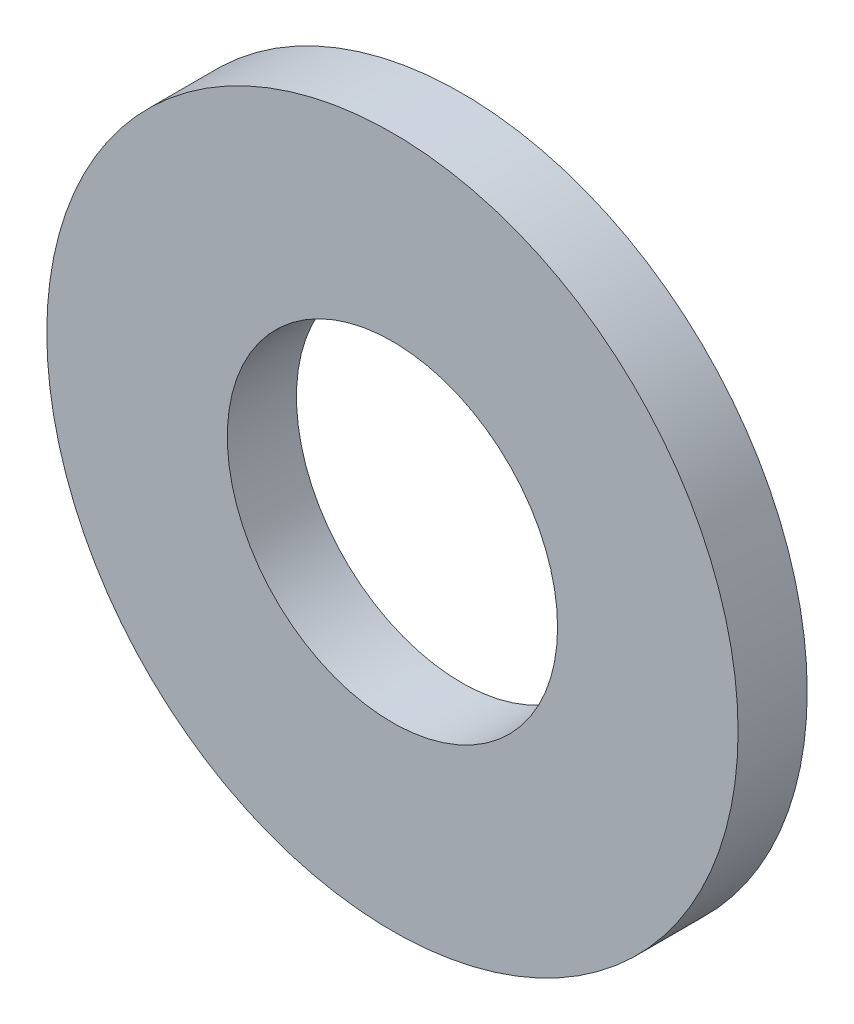
ISO-10303-21;
HEADER;
FILE_DESCRIPTION(('STEP AP214'),'2;1');
FILE_NAME('part.step','',(''),(''),'','','');
FILE_SCHEMA(('AUTOMOTIVE_DESIGN { 1 0 10303 214 1 1 1 1 }'));
ENDSEC;
DATA;
#1=APPLICATION_CONTEXT('core data for automotive mechanical design processes');
#2=APPLICATION_PROTOCOL_DEFINITION('international standard','automotive_design',2000,#1);
#3=PRODUCT_CONTEXT('',#1,'mechanical');
#4=PRODUCT('Part','Part','',(#3));
#5=PRODUCT_RELATED_PRODUCT_CATEGORY('part','',(#4));
#6=PRODUCT_DEFINITION_FORMATION('','',#4);
#7=PRODUCT_DEFINITION_CONTEXT('part definition',#1,'design');
#8=PRODUCT_DEFINITION('design','',#6,#7);
#9=PRODUCT_DEFINITION_SHAPE('','',#8);
#10=(LENGTH_UNIT() NAMED_UNIT(*) SI_UNIT(.MILLI.,.METRE.));
#11=(NAMED_UNIT(*) PLANE_ANGLE_UNIT() SI_UNIT($,.RADIAN.));
#12=(NAMED_UNIT(*) SI_UNIT($,.STERADIAN.) SOLID_ANGLE_UNIT());
#13=UNCERTAINTY_MEASURE_WITH_UNIT(LENGTH_MEASURE(1.E-05),#10,'distance_accuracy_value','');
#14=(GEOMETRIC_REPRESENTATION_CONTEXT(3) GLOBAL_UNCERTAINTY_ASSIGNED_CONTEXT((#13)) GLOBAL_UNIT_ASSIGNED_CONTEXT((#10,
#11,#12)) REPRESENTATION_CONTEXT('',''));
#15=CARTESIAN_POINT('',(0.,0.,0.));
#16=DIRECTION('',(0.,0.,1.));
#17=DIRECTION('',(1.,0.,0.));
#18=AXIS2_PLACEMENT_3D('',#15,#16,#17);
#19=CARTESIAN_POINT('',(0.,0.,0.));
#20=DIRECTION('',(0.,0.,1.));
#21=DIRECTION('',(1.,0.,0.));
#22=AXIS2_PLACEMENT_3D('',#19,#20,#21);
#23=PLANE('',#22);
#24=CARTESIAN_POINT('',(0.,0.,0.));
#25=DIRECTION('',(0.,0.,1.));
#26=DIRECTION('',(1.,0.,0.));
#27=AXIS2_PLACEMENT_3D('',#24,#25,#26);
#28=CIRCLE('',#27,2.15);
#29=CARTESIAN_POINT('',(2.15,0.,0.));
#30=VERTEX_POINT('',#29);
#31=EDGE_CURVE('E27',#30,#30,#28,.T.);
#32=ORIENTED_EDGE('',*,*,#31,.T.);
#33=EDGE_LOOP('',(#32));
#34=FACE_BOUND('',#33,.T.);
#35=CARTESIAN_POINT('',(0.,0.,0.));
#36=DIRECTION('',(0.,0.,1.));
#37=DIRECTION('',(1.,0.,0.));
#38=AXIS2_PLACEMENT_3D('',#35,#36,#37);
#39=CIRCLE('',#38,4.50000000000001);
#40=CARTESIAN_POINT('',(4.50000000000001,0.,0.));
#41=VERTEX_POINT('',#40);
#42=EDGE_CURVE('E18',#41,#41,#39,.T.);
#43=ORIENTED_EDGE('',*,*,#42,.F.);
#44=EDGE_LOOP('',(#43));
#45=FACE_BOUND('',#44,.T.);
#46=ADVANCED_FACE('F15',(#34,#45),#23,.F.);
#47=CARTESIAN_POINT('',(0.,0.,0.));
#48=DIRECTION('',(0.,0.,1.));
#49=DIRECTION('',(1.,0.,0.));
#50=AXIS2_PLACEMENT_3D('',#47,#48,#49);
#51=CYLINDRICAL_SURFACE('',#50,4.50000000000001);
#52=ORIENTED_EDGE('',*,*,#42,.T.);
#53=EDGE_LOOP('',(#52));
#54=FACE_BOUND('',#53,.T.);
#55=CARTESIAN_POINT('',(0.,0.,0.899999999999999));
#56=DIRECTION('',(0.,0.,1.));
#57=DIRECTION('',(1.,0.,0.));
#58=AXIS2_PLACEMENT_3D('',#55,#56,#57);
#59=CIRCLE('',#58,4.50000000000001);
#60=CARTESIAN_POINT('',(4.50000000000001,0.,0.899999999999999));
#61=VERTEX_POINT('',#60);
#62=EDGE_CURVE('E22',#61,#61,#59,.T.);
#63=ORIENTED_EDGE('',*,*,#62,.F.);
#64=EDGE_LOOP('',(#63));
#65=FACE_BOUND('',#64,.T.);
#66=ADVANCED_FACE('F35',(#54,#65),#51,.T.);
#67=CARTESIAN_POINT('',(0.,0.,0.));
#68=DIRECTION('',(0.,0.,1.));
#69=DIRECTION('',(1.,0.,0.));
#70=AXIS2_PLACEMENT_3D('',#67,#68,#69);
#71=CYLINDRICAL_SURFACE('',#70,2.15);
#72=ORIENTED_EDGE('',*,*,#31,.F.);
#73=EDGE_LOOP('',(#72));
#74=FACE_BOUND('',#73,.T.);
#75=CARTESIAN_POINT('',(0.,0.,0.899999999999999));
#76=DIRECTION('',(0.,0.,1.));
#77=DIRECTION('',(1.,0.,0.));
#78=AXIS2_PLACEMENT_3D('',#75,#76,#77);
#79=CIRCLE('',#78,2.15);
#80=CARTESIAN_POINT('',(2.15,0.,0.899999999999999));
#81=VERTEX_POINT('',#80);
#82=EDGE_CURVE('E10',#81,#81,#79,.F.);
#83=ORIENTED_EDGE('',*,*,#82,.F.);
#84=EDGE_LOOP('',(#83));
#85=FACE_BOUND('',#84,.T.);
#86=ADVANCED_FACE('F43',(#74,#85),#71,.F.);
#87=CARTESIAN_POINT('',(0.,0.,0.899999999999999));
#88=DIRECTION('',(0.,0.,1.));
#89=DIRECTION('',(1.,0.,0.));
#90=AXIS2_PLACEMENT_3D('',#87,#88,#89);
#91=PLANE('',#90);
#92=ORIENTED_EDGE('',*,*,#82,.T.);
#93=EDGE_LOOP('',(#92));
#94=FACE_BOUND('',#93,.T.);
#95=ORIENTED_EDGE('',*,*,#62,.T.);
#96=EDGE_LOOP('',(#95));
#97=FACE_BOUND('',#96,.T.);
#98=ADVANCED_FACE('F44',(#94,#97),#91,.T.);
#99=CLOSED_SHELL('',(#46,#66,#86,#98));
#100=MANIFOLD_SOLID_BREP('B1',#99);
#101=ADVANCED_BREP_SHAPE_REPRESENTATION('',(#18,#100),#14);
#102=SHAPE_DEFINITION_REPRESENTATION(#9,#101);
ENDSEC;
END-ISO-10303-21;
